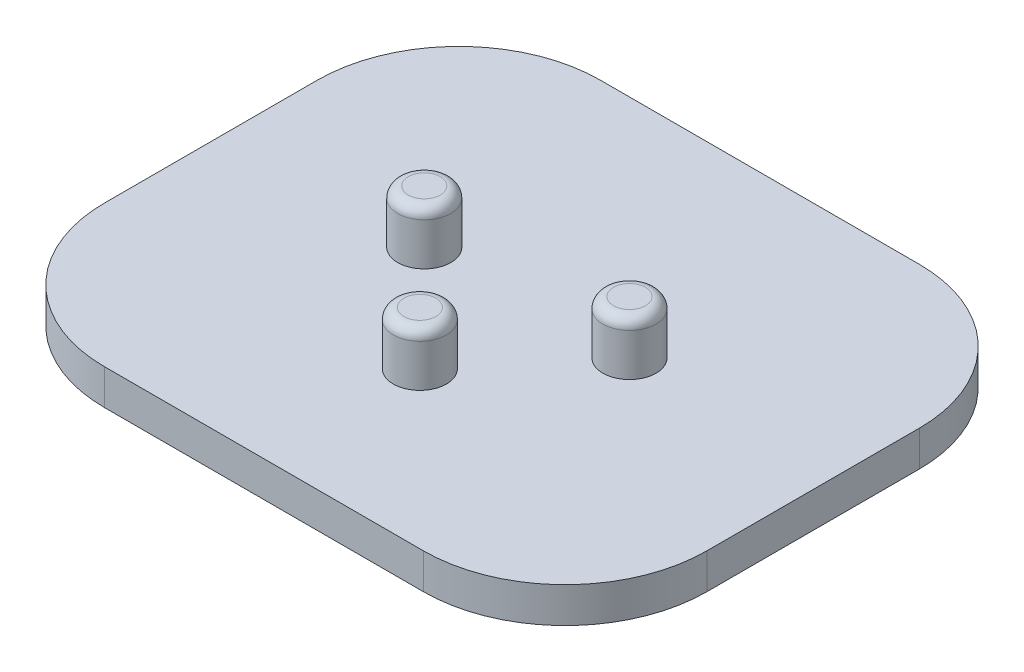
ISO-10303-21;
HEADER;
FILE_DESCRIPTION(('STEP AP214'),'2;1');
FILE_NAME('part.step','',(''),(''),'','','');
FILE_SCHEMA(('AUTOMOTIVE_DESIGN { 1 0 10303 214 1 1 1 1 }'));
ENDSEC;
DATA;
#1=APPLICATION_CONTEXT('core data for automotive mechanical design processes');
#2=APPLICATION_PROTOCOL_DEFINITION('international standard','automotive_design',2000,#1);
#3=PRODUCT_CONTEXT('',#1,'mechanical');
#4=PRODUCT('Part','Part','',(#3));
#5=PRODUCT_RELATED_PRODUCT_CATEGORY('part','',(#4));
#6=PRODUCT_DEFINITION_FORMATION('','',#4);
#7=PRODUCT_DEFINITION_CONTEXT('part definition',#1,'design');
#8=PRODUCT_DEFINITION('design','',#6,#7);
#9=PRODUCT_DEFINITION_SHAPE('','',#8);
#10=(LENGTH_UNIT() NAMED_UNIT(*) SI_UNIT(.MILLI.,.METRE.));
#11=(NAMED_UNIT(*) PLANE_ANGLE_UNIT() SI_UNIT($,.RADIAN.));
#12=(NAMED_UNIT(*) SI_UNIT($,.STERADIAN.) SOLID_ANGLE_UNIT());
#13=UNCERTAINTY_MEASURE_WITH_UNIT(LENGTH_MEASURE(1.E-05),#10,'distance_accuracy_value','');
#14=(GEOMETRIC_REPRESENTATION_CONTEXT(3) GLOBAL_UNCERTAINTY_ASSIGNED_CONTEXT((#13)) GLOBAL_UNIT_ASSIGNED_CONTEXT((#10,
#11,#12)) REPRESENTATION_CONTEXT('',''));
#15=CARTESIAN_POINT('',(0.,0.,0.));
#16=DIRECTION('',(0.,0.,1.));
#17=DIRECTION('',(1.,0.,0.));
#18=AXIS2_PLACEMENT_3D('',#15,#16,#17);
#19=CARTESIAN_POINT('',(0.,5.,0.));
#20=DIRECTION('',(1.,0.,0.));
#21=DIRECTION('',(0.,0.,-1.));
#22=AXIS2_PLACEMENT_3D('',#19,#20,#21);
#23=PLANE('',#22);
#24=DIRECTION('',(0.,0.,1.));
#25=VECTOR('',#24,1.);
#26=CARTESIAN_POINT('',(0.,5.,0.));
#27=LINE('',#26,#25);
#28=CARTESIAN_POINT('',(0.,5.,20.));
#29=VERTEX_POINT('',#28);
#30=CARTESIAN_POINT('',(0.,5.,50.));
#31=VERTEX_POINT('',#30);
#32=EDGE_CURVE('E127',#29,#31,#27,.T.);
#33=ORIENTED_EDGE('',*,*,#32,.F.);
#34=DIRECTION('',(0.,-1.,0.));
#35=VECTOR('',#34,1.);
#36=CARTESIAN_POINT('',(0.,5.,20.));
#37=LINE('',#36,#35);
#38=CARTESIAN_POINT('',(0.,0.,20.));
#39=VERTEX_POINT('',#38);
#40=EDGE_CURVE('E112',#29,#39,#37,.T.);
#41=ORIENTED_EDGE('',*,*,#40,.T.);
#42=DIRECTION('',(0.,0.,1.));
#43=VECTOR('',#42,1.);
#44=CARTESIAN_POINT('',(0.,0.,0.));
#45=LINE('',#44,#43);
#46=CARTESIAN_POINT('',(0.,0.,50.));
#47=VERTEX_POINT('',#46);
#48=EDGE_CURVE('E124',#39,#47,#45,.T.);
#49=ORIENTED_EDGE('',*,*,#48,.T.);
#50=DIRECTION('',(0.,-1.,0.));
#51=VECTOR('',#50,1.);
#52=CARTESIAN_POINT('',(0.,5.,50.));
#53=LINE('',#52,#51);
#54=EDGE_CURVE('E129',#47,#31,#53,.F.);
#55=ORIENTED_EDGE('',*,*,#54,.T.);
#56=EDGE_LOOP('',(#33,#41,#49,#55));
#57=FACE_BOUND('',#56,.T.);
#58=ADVANCED_FACE('F41',(#57),#23,.F.);
#59=CARTESIAN_POINT('',(0.,5.,70.));
#60=DIRECTION('',(0.,0.,-1.));
#61=DIRECTION('',(-1.,0.,0.));
#62=AXIS2_PLACEMENT_3D('',#59,#60,#61);
#63=PLANE('',#62);
#64=DIRECTION('',(1.,0.,0.));
#65=VECTOR('',#64,1.);
#66=CARTESIAN_POINT('',(0.,5.,70.));
#67=LINE('',#66,#65);
#68=CARTESIAN_POINT('',(20.,5.,70.));
#69=VERTEX_POINT('',#68);
#70=CARTESIAN_POINT('',(65.,5.,70.));
#71=VERTEX_POINT('',#70);
#72=EDGE_CURVE('E189',#69,#71,#67,.T.);
#73=ORIENTED_EDGE('',*,*,#72,.F.);
#74=DIRECTION('',(0.,-1.,0.));
#75=VECTOR('',#74,1.);
#76=CARTESIAN_POINT('',(20.,5.,70.));
#77=LINE('',#76,#75);
#78=CARTESIAN_POINT('',(20.,0.,70.));
#79=VERTEX_POINT('',#78);
#80=EDGE_CURVE('E11',#69,#79,#77,.T.);
#81=ORIENTED_EDGE('',*,*,#80,.T.);
#82=DIRECTION('',(1.,0.,0.));
#83=VECTOR('',#82,1.);
#84=CARTESIAN_POINT('',(0.,0.,70.));
#85=LINE('',#84,#83);
#86=CARTESIAN_POINT('',(65.,0.,70.));
#87=VERTEX_POINT('',#86);
#88=EDGE_CURVE('E134',#79,#87,#85,.T.);
#89=ORIENTED_EDGE('',*,*,#88,.T.);
#90=DIRECTION('',(0.,-1.,0.));
#91=VECTOR('',#90,1.);
#92=CARTESIAN_POINT('',(65.,5.,70.));
#93=LINE('',#92,#91);
#94=EDGE_CURVE('E49',#87,#71,#93,.F.);
#95=ORIENTED_EDGE('',*,*,#94,.T.);
#96=EDGE_LOOP('',(#73,#81,#89,#95));
#97=FACE_BOUND('',#96,.T.);
#98=ADVANCED_FACE('F188',(#97),#63,.F.);
#99=CARTESIAN_POINT('',(85.,5.,0.));
#100=DIRECTION('',(-1.,0.,0.));
#101=DIRECTION('',(0.,0.,1.));
#102=AXIS2_PLACEMENT_3D('',#99,#100,#101);
#103=PLANE('',#102);
#104=DIRECTION('',(0.,0.,-1.));
#105=VECTOR('',#104,1.);
#106=CARTESIAN_POINT('',(85.,0.,0.));
#107=LINE('',#106,#105);
#108=CARTESIAN_POINT('',(85.,0.,50.));
#109=VERTEX_POINT('',#108);
#110=CARTESIAN_POINT('',(85.,0.,20.));
#111=VERTEX_POINT('',#110);
#112=EDGE_CURVE('E138',#109,#111,#107,.T.);
#113=ORIENTED_EDGE('',*,*,#112,.T.);
#114=DIRECTION('',(0.,-1.,0.));
#115=VECTOR('',#114,1.);
#116=CARTESIAN_POINT('',(85.,5.,20.));
#117=LINE('',#116,#115);
#118=CARTESIAN_POINT('',(85.,5.,20.));
#119=VERTEX_POINT('',#118);
#120=EDGE_CURVE('E56',#111,#119,#117,.F.);
#121=ORIENTED_EDGE('',*,*,#120,.T.);
#122=DIRECTION('',(0.,0.,-1.));
#123=VECTOR('',#122,1.);
#124=CARTESIAN_POINT('',(85.,5.,0.));
#125=LINE('',#124,#123);
#126=CARTESIAN_POINT('',(85.,5.,50.));
#127=VERTEX_POINT('',#126);
#128=EDGE_CURVE('E195',#127,#119,#125,.T.);
#129=ORIENTED_EDGE('',*,*,#128,.F.);
#130=DIRECTION('',(0.,-1.,0.));
#131=VECTOR('',#130,1.);
#132=CARTESIAN_POINT('',(85.,5.,50.));
#133=LINE('',#132,#131);
#134=EDGE_CURVE('E182',#127,#109,#133,.T.);
#135=ORIENTED_EDGE('',*,*,#134,.T.);
#136=EDGE_LOOP('',(#113,#121,#129,#135));
#137=FACE_BOUND('',#136,.T.);
#138=ADVANCED_FACE('F199',(#137),#103,.F.);
#139=CARTESIAN_POINT('',(0.,5.,0.));
#140=DIRECTION('',(0.,0.,1.));
#141=DIRECTION('',(1.,0.,0.));
#142=AXIS2_PLACEMENT_3D('',#139,#140,#141);
#143=PLANE('',#142);
#144=DIRECTION('',(-1.,0.,0.));
#145=VECTOR('',#144,1.);
#146=CARTESIAN_POINT('',(0.,0.,0.));
#147=LINE('',#146,#145);
#148=CARTESIAN_POINT('',(65.,0.,0.));
#149=VERTEX_POINT('',#148);
#150=CARTESIAN_POINT('',(20.,0.,0.));
#151=VERTEX_POINT('',#150);
#152=EDGE_CURVE('E148',#149,#151,#147,.T.);
#153=ORIENTED_EDGE('',*,*,#152,.T.);
#154=DIRECTION('',(0.,-1.,0.));
#155=VECTOR('',#154,1.);
#156=CARTESIAN_POINT('',(20.,5.,0.));
#157=LINE('',#156,#155);
#158=CARTESIAN_POINT('',(20.,5.,0.));
#159=VERTEX_POINT('',#158);
#160=EDGE_CURVE('E113',#151,#159,#157,.F.);
#161=ORIENTED_EDGE('',*,*,#160,.T.);
#162=DIRECTION('',(-1.,0.,0.));
#163=VECTOR('',#162,1.);
#164=CARTESIAN_POINT('',(0.,5.,0.));
#165=LINE('',#164,#163);
#166=CARTESIAN_POINT('',(65.,5.,0.));
#167=VERTEX_POINT('',#166);
#168=EDGE_CURVE('E144',#167,#159,#165,.T.);
#169=ORIENTED_EDGE('',*,*,#168,.F.);
#170=DIRECTION('',(0.,-1.,0.));
#171=VECTOR('',#170,1.);
#172=CARTESIAN_POINT('',(65.,5.,0.));
#173=LINE('',#172,#171);
#174=EDGE_CURVE('E118',#167,#149,#173,.T.);
#175=ORIENTED_EDGE('',*,*,#174,.T.);
#176=EDGE_LOOP('',(#153,#161,#169,#175));
#177=FACE_BOUND('',#176,.T.);
#178=ADVANCED_FACE('F206',(#177),#143,.F.);
#179=CARTESIAN_POINT('',(0.,5.,0.));
#180=DIRECTION('',(0.,1.,0.));
#181=DIRECTION('',(0.,0.,1.));
#182=AXIS2_PLACEMENT_3D('',#179,#180,#181);
#183=PLANE('',#182);
#184=CARTESIAN_POINT('',(42.5,5.,48.));
#185=DIRECTION('',(0.,1.,0.));
#186=DIRECTION('',(0.,0.,1.));
#187=AXIS2_PLACEMENT_3D('',#184,#185,#186);
#188=CIRCLE('',#187,3.75000000000001);
#189=CARTESIAN_POINT('',(42.5,5.,51.75));
#190=VERTEX_POINT('',#189);
#191=EDGE_CURVE('E211',#190,#190,#188,.T.);
#192=ORIENTED_EDGE('',*,*,#191,.F.);
#193=EDGE_LOOP('',(#192));
#194=FACE_BOUND('',#193,.T.);
#195=CARTESIAN_POINT('',(55.9648996056108,5.,31.8848990505544));
#196=DIRECTION('',(0.,1.,0.));
#197=DIRECTION('',(0.,0.,1.));
#198=AXIS2_PLACEMENT_3D('',#195,#196,#197);
#199=CIRCLE('',#198,3.75000000000001);
#200=CARTESIAN_POINT('',(55.9648996056108,5.,35.6348990505544));
#201=VERTEX_POINT('',#200);
#202=EDGE_CURVE('E141',#201,#201,#199,.T.);
#203=ORIENTED_EDGE('',*,*,#202,.F.);
#204=EDGE_LOOP('',(#203));
#205=FACE_BOUND('',#204,.T.);
#206=CARTESIAN_POINT('',(27.9648996056108,5.,32.843125106902));
#207=DIRECTION('',(0.,1.,0.));
#208=DIRECTION('',(0.,0.,1.));
#209=AXIS2_PLACEMENT_3D('',#206,#207,#208);
#210=CIRCLE('',#209,3.75);
#211=CARTESIAN_POINT('',(27.9648996056108,5.,36.593125106902));
#212=VERTEX_POINT('',#211);
#213=EDGE_CURVE('E135',#212,#212,#210,.T.);
#214=ORIENTED_EDGE('',*,*,#213,.F.);
#215=EDGE_LOOP('',(#214));
#216=FACE_BOUND('',#215,.T.);
#217=ORIENTED_EDGE('',*,*,#168,.T.);
#218=CARTESIAN_POINT('',(20.,5.,20.));
#219=DIRECTION('',(0.,1.,0.));
#220=DIRECTION('',(0.,0.,1.));
#221=AXIS2_PLACEMENT_3D('',#218,#219,#220);
#222=CIRCLE('',#221,20.);
#223=EDGE_CURVE('E180',#159,#29,#222,.T.);
#224=ORIENTED_EDGE('',*,*,#223,.T.);
#225=ORIENTED_EDGE('',*,*,#32,.T.);
#226=CARTESIAN_POINT('',(20.,5.,50.));
#227=DIRECTION('',(0.,1.,0.));
#228=DIRECTION('',(0.,0.,1.));
#229=AXIS2_PLACEMENT_3D('',#226,#227,#228);
#230=CIRCLE('',#229,20.);
#231=EDGE_CURVE('E176',#31,#69,#230,.T.);
#232=ORIENTED_EDGE('',*,*,#231,.T.);
#233=ORIENTED_EDGE('',*,*,#72,.T.);
#234=CARTESIAN_POINT('',(65.,5.,50.));
#235=DIRECTION('',(0.,1.,0.));
#236=DIRECTION('',(0.,0.,1.));
#237=AXIS2_PLACEMENT_3D('',#234,#235,#236);
#238=CIRCLE('',#237,20.);
#239=EDGE_CURVE('E63',#71,#127,#238,.T.);
#240=ORIENTED_EDGE('',*,*,#239,.T.);
#241=ORIENTED_EDGE('',*,*,#128,.T.);
#242=CARTESIAN_POINT('',(65.,5.,20.));
#243=DIRECTION('',(0.,1.,0.));
#244=DIRECTION('',(0.,0.,1.));
#245=AXIS2_PLACEMENT_3D('',#242,#243,#244);
#246=CIRCLE('',#245,20.);
#247=EDGE_CURVE('E178',#119,#167,#246,.T.);
#248=ORIENTED_EDGE('',*,*,#247,.T.);
#249=EDGE_LOOP('',(#217,#224,#225,#232,#233,#240,#241,#248));
#250=FACE_BOUND('',#249,.T.);
#251=ADVANCED_FACE('F193',(#194,#205,#216,#250),#183,.T.);
#252=CARTESIAN_POINT('',(0.,0.,0.));
#253=DIRECTION('',(0.,1.,0.));
#254=DIRECTION('',(0.,0.,1.));
#255=AXIS2_PLACEMENT_3D('',#252,#253,#254);
#256=PLANE('',#255);
#257=ORIENTED_EDGE('',*,*,#48,.F.);
#258=CARTESIAN_POINT('',(20.,0.,20.));
#259=DIRECTION('',(0.,1.,0.));
#260=DIRECTION('',(0.,0.,1.));
#261=AXIS2_PLACEMENT_3D('',#258,#259,#260);
#262=CIRCLE('',#261,20.);
#263=EDGE_CURVE('E108',#39,#151,#262,.F.);
#264=ORIENTED_EDGE('',*,*,#263,.T.);
#265=ORIENTED_EDGE('',*,*,#152,.F.);
#266=CARTESIAN_POINT('',(65.,0.,20.));
#267=DIRECTION('',(0.,1.,0.));
#268=DIRECTION('',(0.,0.,1.));
#269=AXIS2_PLACEMENT_3D('',#266,#267,#268);
#270=CIRCLE('',#269,20.);
#271=EDGE_CURVE('E119',#149,#111,#270,.F.);
#272=ORIENTED_EDGE('',*,*,#271,.T.);
#273=ORIENTED_EDGE('',*,*,#112,.F.);
#274=CARTESIAN_POINT('',(65.,0.,50.));
#275=DIRECTION('',(0.,1.,0.));
#276=DIRECTION('',(0.,0.,1.));
#277=AXIS2_PLACEMENT_3D('',#274,#275,#276);
#278=CIRCLE('',#277,20.);
#279=EDGE_CURVE('E128',#109,#87,#278,.F.);
#280=ORIENTED_EDGE('',*,*,#279,.T.);
#281=ORIENTED_EDGE('',*,*,#88,.F.);
#282=CARTESIAN_POINT('',(20.,0.,50.));
#283=DIRECTION('',(0.,1.,0.));
#284=DIRECTION('',(0.,0.,1.));
#285=AXIS2_PLACEMENT_3D('',#282,#283,#284);
#286=CIRCLE('',#285,20.);
#287=EDGE_CURVE('E133',#79,#47,#286,.F.);
#288=ORIENTED_EDGE('',*,*,#287,.T.);
#289=EDGE_LOOP('',(#257,#264,#265,#272,#273,#280,#281,#288));
#290=FACE_BOUND('',#289,.T.);
#291=ADVANCED_FACE('F131',(#290),#256,.F.);
#292=CARTESIAN_POINT('',(27.9648996056108,12.5,32.843125106902));
#293=DIRECTION('',(0.,-1.,0.));
#294=DIRECTION('',(0.,0.,-1.));
#295=AXIS2_PLACEMENT_3D('',#292,#293,#294);
#296=CYLINDRICAL_SURFACE('',#295,3.75);
#297=CARTESIAN_POINT('',(27.9648996056108,11.,32.843125106902));
#298=DIRECTION('',(0.,1.,0.));
#299=DIRECTION('',(0.,0.,1.));
#300=AXIS2_PLACEMENT_3D('',#297,#298,#299);
#301=CIRCLE('',#300,3.75);
#302=CARTESIAN_POINT('',(27.9648996056108,11.,36.593125106902));
#303=VERTEX_POINT('',#302);
#304=EDGE_CURVE('E153',#303,#303,#301,.F.);
#305=ORIENTED_EDGE('',*,*,#304,.T.);
#306=EDGE_LOOP('',(#305));
#307=FACE_BOUND('',#306,.T.);
#308=ORIENTED_EDGE('',*,*,#213,.T.);
#309=EDGE_LOOP('',(#308));
#310=FACE_BOUND('',#309,.T.);
#311=ADVANCED_FACE('F224',(#307,#310),#296,.T.);
#312=CARTESIAN_POINT('',(0.,12.5,0.));
#313=DIRECTION('',(0.,1.,0.));
#314=DIRECTION('',(0.,0.,1.));
#315=AXIS2_PLACEMENT_3D('',#312,#313,#314);
#316=PLANE('',#315);
#317=CARTESIAN_POINT('',(27.9648996056108,12.5,32.843125106902));
#318=DIRECTION('',(0.,1.,0.));
#319=DIRECTION('',(0.,0.,1.));
#320=AXIS2_PLACEMENT_3D('',#317,#318,#319);
#321=CIRCLE('',#320,2.25);
#322=CARTESIAN_POINT('',(27.9648996056108,12.5,35.093125106902));
#323=VERTEX_POINT('',#322);
#324=EDGE_CURVE('E150',#323,#323,#321,.T.);
#325=ORIENTED_EDGE('',*,*,#324,.T.);
#326=EDGE_LOOP('',(#325));
#327=FACE_BOUND('',#326,.T.);
#328=ADVANCED_FACE('F226',(#327),#316,.T.);
#329=CARTESIAN_POINT('',(55.9648996056108,12.5,31.8848990505544));
#330=DIRECTION('',(0.,-1.,0.));
#331=DIRECTION('',(0.,0.,-1.));
#332=AXIS2_PLACEMENT_3D('',#329,#330,#331);
#333=CYLINDRICAL_SURFACE('',#332,3.75000000000001);
#334=CARTESIAN_POINT('',(55.9648996056108,11.,31.8848990505544));
#335=DIRECTION('',(0.,1.,0.));
#336=DIRECTION('',(0.,0.,1.));
#337=AXIS2_PLACEMENT_3D('',#334,#335,#336);
#338=CIRCLE('',#337,3.75000000000001);
#339=CARTESIAN_POINT('',(55.9648996056108,11.,35.6348990505544));
#340=VERTEX_POINT('',#339);
#341=EDGE_CURVE('E159',#340,#340,#338,.F.);
#342=ORIENTED_EDGE('',*,*,#341,.T.);
#343=EDGE_LOOP('',(#342));
#344=FACE_BOUND('',#343,.T.);
#345=ORIENTED_EDGE('',*,*,#202,.T.);
#346=EDGE_LOOP('',(#345));
#347=FACE_BOUND('',#346,.T.);
#348=ADVANCED_FACE('F232',(#344,#347),#333,.T.);
#349=CARTESIAN_POINT('',(0.,12.5,0.));
#350=DIRECTION('',(0.,1.,0.));
#351=DIRECTION('',(0.,0.,1.));
#352=AXIS2_PLACEMENT_3D('',#349,#350,#351);
#353=PLANE('',#352);
#354=CARTESIAN_POINT('',(55.9648996056108,12.5,31.8848990505544));
#355=DIRECTION('',(0.,1.,0.));
#356=DIRECTION('',(0.,0.,1.));
#357=AXIS2_PLACEMENT_3D('',#354,#355,#356);
#358=CIRCLE('',#357,2.25000000000001);
#359=CARTESIAN_POINT('',(55.9648996056108,12.5,34.1348990505544));
#360=VERTEX_POINT('',#359);
#361=EDGE_CURVE('E156',#360,#360,#358,.T.);
#362=ORIENTED_EDGE('',*,*,#361,.T.);
#363=EDGE_LOOP('',(#362));
#364=FACE_BOUND('',#363,.T.);
#365=ADVANCED_FACE('F323',(#364),#353,.T.);
#366=CARTESIAN_POINT('',(42.5,12.5,48.));
#367=DIRECTION('',(0.,-1.,0.));
#368=DIRECTION('',(0.,0.,-1.));
#369=AXIS2_PLACEMENT_3D('',#366,#367,#368);
#370=CYLINDRICAL_SURFACE('',#369,3.75000000000001);
#371=CARTESIAN_POINT('',(42.5,11.,48.));
#372=DIRECTION('',(0.,1.,0.));
#373=DIRECTION('',(0.,0.,1.));
#374=AXIS2_PLACEMENT_3D('',#371,#372,#373);
#375=CIRCLE('',#374,3.75000000000001);
#376=CARTESIAN_POINT('',(42.5,11.,51.75));
#377=VERTEX_POINT('',#376);
#378=EDGE_CURVE('E165',#377,#377,#375,.F.);
#379=ORIENTED_EDGE('',*,*,#378,.T.);
#380=EDGE_LOOP('',(#379));
#381=FACE_BOUND('',#380,.T.);
#382=ORIENTED_EDGE('',*,*,#191,.T.);
#383=EDGE_LOOP('',(#382));
#384=FACE_BOUND('',#383,.T.);
#385=ADVANCED_FACE('F215',(#381,#384),#370,.T.);
#386=CARTESIAN_POINT('',(0.,12.5,0.));
#387=DIRECTION('',(0.,1.,0.));
#388=DIRECTION('',(0.,0.,1.));
#389=AXIS2_PLACEMENT_3D('',#386,#387,#388);
#390=PLANE('',#389);
#391=CARTESIAN_POINT('',(42.5,12.5,48.));
#392=DIRECTION('',(0.,1.,0.));
#393=DIRECTION('',(0.,0.,1.));
#394=AXIS2_PLACEMENT_3D('',#391,#392,#393);
#395=CIRCLE('',#394,2.25000000000001);
#396=CARTESIAN_POINT('',(42.5,12.5,50.25));
#397=VERTEX_POINT('',#396);
#398=EDGE_CURVE('E162',#397,#397,#395,.T.);
#399=ORIENTED_EDGE('',*,*,#398,.T.);
#400=EDGE_LOOP('',(#399));
#401=FACE_BOUND('',#400,.T.);
#402=ADVANCED_FACE('F250',(#401),#390,.T.);
#403=CARTESIAN_POINT('',(27.9648996056108,11.,32.843125106902));
#404=DIRECTION('',(0.,1.,0.));
#405=DIRECTION('',(0.,0.,1.));
#406=AXIS2_PLACEMENT_3D('',#403,#404,#405);
#407=TOROIDAL_SURFACE('',#406,2.25,1.5);
#408=ORIENTED_EDGE('',*,*,#304,.F.);
#409=EDGE_LOOP('',(#408));
#410=FACE_BOUND('',#409,.T.);
#411=ORIENTED_EDGE('',*,*,#324,.F.);
#412=EDGE_LOOP('',(#411));
#413=FACE_BOUND('',#412,.T.);
#414=ADVANCED_FACE('F246',(#410,#413),#407,.T.);
#415=CARTESIAN_POINT('',(55.9648996056108,11.,31.8848990505544));
#416=DIRECTION('',(0.,1.,0.));
#417=DIRECTION('',(0.,0.,1.));
#418=AXIS2_PLACEMENT_3D('',#415,#416,#417);
#419=TOROIDAL_SURFACE('',#418,2.25000000000001,1.5);
#420=ORIENTED_EDGE('',*,*,#341,.F.);
#421=EDGE_LOOP('',(#420));
#422=FACE_BOUND('',#421,.T.);
#423=ORIENTED_EDGE('',*,*,#361,.F.);
#424=EDGE_LOOP('',(#423));
#425=FACE_BOUND('',#424,.T.);
#426=ADVANCED_FACE('F249',(#422,#425),#419,.T.);
#427=CARTESIAN_POINT('',(42.5,11.,48.));
#428=DIRECTION('',(0.,1.,0.));
#429=DIRECTION('',(0.,0.,1.));
#430=AXIS2_PLACEMENT_3D('',#427,#428,#429);
#431=TOROIDAL_SURFACE('',#430,2.25000000000001,1.5);
#432=ORIENTED_EDGE('',*,*,#378,.F.);
#433=EDGE_LOOP('',(#432));
#434=FACE_BOUND('',#433,.T.);
#435=ORIENTED_EDGE('',*,*,#398,.F.);
#436=EDGE_LOOP('',(#435));
#437=FACE_BOUND('',#436,.T.);
#438=ADVANCED_FACE('F254',(#434,#437),#431,.T.);
#439=CARTESIAN_POINT('',(20.,5.,20.));
#440=DIRECTION('',(0.,-1.,0.));
#441=DIRECTION('',(0.,0.,-1.));
#442=AXIS2_PLACEMENT_3D('',#439,#440,#441);
#443=CYLINDRICAL_SURFACE('',#442,20.);
#444=ORIENTED_EDGE('',*,*,#223,.F.);
#445=ORIENTED_EDGE('',*,*,#160,.F.);
#446=ORIENTED_EDGE('',*,*,#263,.F.);
#447=ORIENTED_EDGE('',*,*,#40,.F.);
#448=EDGE_LOOP('',(#444,#445,#446,#447));
#449=FACE_BOUND('',#448,.T.);
#450=ADVANCED_FACE('F111',(#449),#443,.T.);
#451=CARTESIAN_POINT('',(65.,5.,20.));
#452=DIRECTION('',(0.,-1.,0.));
#453=DIRECTION('',(0.,0.,-1.));
#454=AXIS2_PLACEMENT_3D('',#451,#452,#453);
#455=CYLINDRICAL_SURFACE('',#454,20.);
#456=ORIENTED_EDGE('',*,*,#247,.F.);
#457=ORIENTED_EDGE('',*,*,#120,.F.);
#458=ORIENTED_EDGE('',*,*,#271,.F.);
#459=ORIENTED_EDGE('',*,*,#174,.F.);
#460=EDGE_LOOP('',(#456,#457,#458,#459));
#461=FACE_BOUND('',#460,.T.);
#462=ADVANCED_FACE('F203',(#461),#455,.T.);
#463=CARTESIAN_POINT('',(20.,5.,50.));
#464=DIRECTION('',(0.,-1.,0.));
#465=DIRECTION('',(0.,0.,-1.));
#466=AXIS2_PLACEMENT_3D('',#463,#464,#465);
#467=CYLINDRICAL_SURFACE('',#466,20.);
#468=ORIENTED_EDGE('',*,*,#231,.F.);
#469=ORIENTED_EDGE('',*,*,#54,.F.);
#470=ORIENTED_EDGE('',*,*,#287,.F.);
#471=ORIENTED_EDGE('',*,*,#80,.F.);
#472=EDGE_LOOP('',(#468,#469,#470,#471));
#473=FACE_BOUND('',#472,.T.);
#474=ADVANCED_FACE('F261',(#473),#467,.T.);
#475=CARTESIAN_POINT('',(65.,5.,50.));
#476=DIRECTION('',(0.,-1.,0.));
#477=DIRECTION('',(0.,0.,-1.));
#478=AXIS2_PLACEMENT_3D('',#475,#476,#477);
#479=CYLINDRICAL_SURFACE('',#478,20.);
#480=ORIENTED_EDGE('',*,*,#239,.F.);
#481=ORIENTED_EDGE('',*,*,#94,.F.);
#482=ORIENTED_EDGE('',*,*,#279,.F.);
#483=ORIENTED_EDGE('',*,*,#134,.F.);
#484=EDGE_LOOP('',(#480,#481,#482,#483));
#485=FACE_BOUND('',#484,.T.);
#486=ADVANCED_FACE('F43',(#485),#479,.T.);
#487=CLOSED_SHELL('',(#58,#98,#138,#178,#251,#291,#311,#328,#348,#365,#385,#402,#414,#426,#438,
#450,#462,#474,#486));
#488=MANIFOLD_SOLID_BREP('B2',#487);
#489=ADVANCED_BREP_SHAPE_REPRESENTATION('',(#18,#488),#14);
#490=SHAPE_DEFINITION_REPRESENTATION(#9,#489);
ENDSEC;
END-ISO-10303-21;
